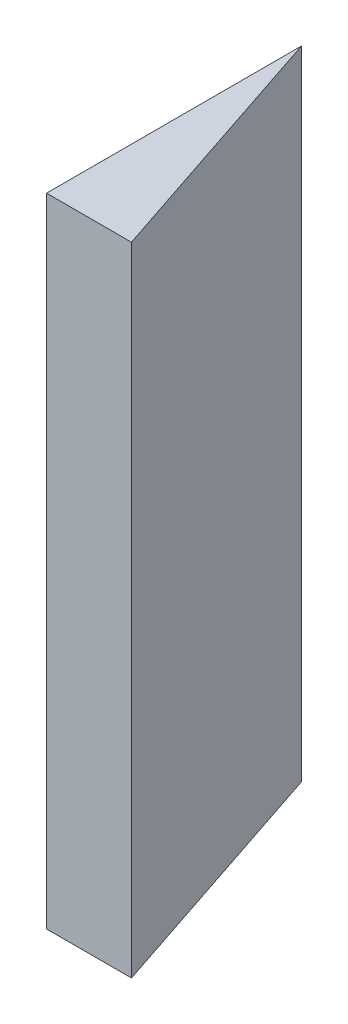
ISO-10303-21;
HEADER;
FILE_DESCRIPTION(('STEP AP214'),'2;1');
FILE_NAME('part.step','',(''),(''),'','','');
FILE_SCHEMA(('AUTOMOTIVE_DESIGN { 1 0 10303 214 1 1 1 1 }'));
ENDSEC;
DATA;
#1=APPLICATION_CONTEXT('core data for automotive mechanical design processes');
#2=APPLICATION_PROTOCOL_DEFINITION('international standard','automotive_design',2000,#1);
#3=PRODUCT_CONTEXT('',#1,'mechanical');
#4=PRODUCT('Part','Part','',(#3));
#5=PRODUCT_RELATED_PRODUCT_CATEGORY('part','',(#4));
#6=PRODUCT_DEFINITION_FORMATION('','',#4);
#7=PRODUCT_DEFINITION_CONTEXT('part definition',#1,'design');
#8=PRODUCT_DEFINITION('design','',#6,#7);
#9=PRODUCT_DEFINITION_SHAPE('','',#8);
#10=(LENGTH_UNIT() NAMED_UNIT(*) SI_UNIT(.MILLI.,.METRE.));
#11=(NAMED_UNIT(*) PLANE_ANGLE_UNIT() SI_UNIT($,.RADIAN.));
#12=(NAMED_UNIT(*) SI_UNIT($,.STERADIAN.) SOLID_ANGLE_UNIT());
#13=UNCERTAINTY_MEASURE_WITH_UNIT(LENGTH_MEASURE(1.E-05),#10,'distance_accuracy_value','');
#14=(GEOMETRIC_REPRESENTATION_CONTEXT(3) GLOBAL_UNCERTAINTY_ASSIGNED_CONTEXT((#13)) GLOBAL_UNIT_ASSIGNED_CONTEXT((#10,
#11,#12)) REPRESENTATION_CONTEXT('',''));
#15=CARTESIAN_POINT('',(0.,0.,0.));
#16=DIRECTION('',(0.,0.,1.));
#17=DIRECTION('',(1.,0.,0.));
#18=AXIS2_PLACEMENT_3D('',#15,#16,#17);
#19=CARTESIAN_POINT('',(-3.92000013113415,-0.749999132765057,-3.67112145542904));
#20=DIRECTION('',(-1.74845553146952E-07,-1.,8.74227765734759E-08));
#21=DIRECTION('',(1.,-1.74845553146952E-07,0.));
#22=AXIS2_PLACEMENT_3D('',#19,#20,#21);
#23=PLANE('',#22);
#24=DIRECTION('',(0.,-8.74227765179645E-08,-0.999999999999996));
#25=VECTOR('',#24,1.);
#26=CARTESIAN_POINT('',(-3.90000013113415,-0.749999099544401,-3.25112145542904));
#27=LINE('',#26,#25);
#28=CARTESIAN_POINT('',(-3.90000013113415,-0.749999099546401,-3.25112145542904));
#29=VERTEX_POINT('',#28);
#30=CARTESIAN_POINT('',(-3.90000013113415,-0.749999134515512,-3.65112145542904));
#31=VERTEX_POINT('',#30);
#32=EDGE_CURVE('E11',#29,#31,#27,.T.);
#33=ORIENTED_EDGE('',*,*,#32,.F.);
#34=DIRECTION('',(-0.999999999999985,1.74845553322983E-07,0.));
#35=VECTOR('',#34,1.);
#36=CARTESIAN_POINT('',(-3.76677795649015,-0.749999122837706,-3.25112145542904));
#37=LINE('',#36,#35);
#38=CARTESIAN_POINT('',(-3.76677795649015,-0.749999122839706,-3.25112145542904));
#39=VERTEX_POINT('',#38);
#40=EDGE_CURVE('E63',#39,#29,#37,.T.);
#41=ORIENTED_EDGE('',*,*,#40,.F.);
#42=DIRECTION('',(0.315990463967212,2.76939127533256E-08,0.948762365759617));
#43=VECTOR('',#42,1.);
#44=CARTESIAN_POINT('',(-3.90000013113415,-0.749999134513512,-3.65112145542904));
#45=LINE('',#44,#43);
#46=EDGE_CURVE('E70',#31,#39,#45,.T.);
#47=ORIENTED_EDGE('',*,*,#46,.F.);
#48=EDGE_LOOP('',(#33,#41,#47));
#49=FACE_BOUND('',#48,.T.);
#50=ADVANCED_FACE('F17',(#49),#23,.F.);
#51=CARTESIAN_POINT('',(-3.9200003059797,-1.74999913276606,-3.67112136800626));
#52=DIRECTION('',(-1.74845553146952E-07,-1.,8.74227765734759E-08));
#53=DIRECTION('',(1.,-1.74845553146952E-07,0.));
#54=AXIS2_PLACEMENT_3D('',#51,#52,#53);
#55=PLANE('',#54);
#56=DIRECTION('',(0.315990463967212,2.76939124899912E-08,0.948762365759617));
#57=VECTOR('',#56,1.);
#58=CARTESIAN_POINT('',(-3.9000003059797,-1.74999913451451,-3.65112136800626));
#59=LINE('',#58,#57);
#60=CARTESIAN_POINT('',(-3.9000003059797,-1.74999913451351,-3.65112136800626));
#61=VERTEX_POINT('',#60);
#62=CARTESIAN_POINT('',(-3.7667781313357,-1.74999912283771,-3.25112136800626));
#63=VERTEX_POINT('',#62);
#64=EDGE_CURVE('E24',#61,#63,#59,.T.);
#65=ORIENTED_EDGE('',*,*,#64,.T.);
#66=DIRECTION('',(-0.999999999999985,1.74845553322982E-07,0.));
#67=VECTOR('',#66,1.);
#68=CARTESIAN_POINT('',(-3.7667781313357,-1.74999912283871,-3.25112136800626));
#69=LINE('',#68,#67);
#70=CARTESIAN_POINT('',(-3.9000003059797,-1.7499990995444,-3.25112136800626));
#71=VERTEX_POINT('',#70);
#72=EDGE_CURVE('E49',#63,#71,#69,.T.);
#73=ORIENTED_EDGE('',*,*,#72,.T.);
#74=DIRECTION('',(0.,-8.74227762404086E-08,-0.999999999999996));
#75=VECTOR('',#74,1.);
#76=CARTESIAN_POINT('',(-3.9000003059797,-1.7499990995454,-3.25112136800626));
#77=LINE('',#76,#75);
#78=EDGE_CURVE('E46',#71,#61,#77,.T.);
#79=ORIENTED_EDGE('',*,*,#78,.T.);
#80=EDGE_LOOP('',(#65,#73,#79));
#81=FACE_BOUND('',#80,.T.);
#82=ADVANCED_FACE('F47',(#81),#55,.T.);
#83=CARTESIAN_POINT('',(-3.90000013113415,-0.749999134513512,-3.65112145542904));
#84=DIRECTION('',(0.948762365759617,-1.93511644350672E-07,-0.315990463967199));
#85=DIRECTION('',(0.315990463967214,2.76939128616174E-08,0.948762365759622));
#86=AXIS2_PLACEMENT_3D('',#83,#84,#85);
#87=PLANE('',#86);
#88=ORIENTED_EDGE('',*,*,#46,.T.);
#89=DIRECTION('',(-1.74845553146774E-07,-0.999999999999981,8.74227765733868E-08));
#90=VECTOR('',#89,1.);
#91=CARTESIAN_POINT('',(-3.76677795649015,-0.749999122837706,-3.25112145542904));
#92=LINE('',#91,#90);
#93=EDGE_CURVE('E54',#39,#63,#92,.T.);
#94=ORIENTED_EDGE('',*,*,#93,.T.);
#95=ORIENTED_EDGE('',*,*,#64,.F.);
#96=DIRECTION('',(-1.74845553146774E-07,-0.999999999999981,8.74227765733868E-08));
#97=VECTOR('',#96,1.);
#98=CARTESIAN_POINT('',(-3.90000013113415,-0.749999134513512,-3.65112145542904));
#99=LINE('',#98,#97);
#100=EDGE_CURVE('E61',#31,#61,#99,.T.);
#101=ORIENTED_EDGE('',*,*,#100,.F.);
#102=EDGE_LOOP('',(#88,#94,#95,#101));
#103=FACE_BOUND('',#102,.T.);
#104=ADVANCED_FACE('F60',(#103),#87,.T.);
#105=CARTESIAN_POINT('',(-3.76677795649015,-0.749999122837706,-3.25112145542904));
#106=DIRECTION('',(0.,8.74227765734759E-08,1.));
#107=DIRECTION('',(-1.,1.74845553146952E-07,0.));
#108=AXIS2_PLACEMENT_3D('',#105,#106,#107);
#109=PLANE('',#108);
#110=ORIENTED_EDGE('',*,*,#40,.T.);
#111=DIRECTION('',(-1.74845553146774E-07,-0.999999999999981,8.74227765733868E-08));
#112=VECTOR('',#111,1.);
#113=CARTESIAN_POINT('',(-3.90000013113415,-0.749999099544401,-3.25112145542904));
#114=LINE('',#113,#112);
#115=EDGE_CURVE('E55',#29,#71,#114,.T.);
#116=ORIENTED_EDGE('',*,*,#115,.T.);
#117=ORIENTED_EDGE('',*,*,#72,.F.);
#118=ORIENTED_EDGE('',*,*,#93,.F.);
#119=EDGE_LOOP('',(#110,#116,#117,#118));
#120=FACE_BOUND('',#119,.T.);
#121=ADVANCED_FACE('F73',(#120),#109,.T.);
#122=CARTESIAN_POINT('',(-3.90000013113415,-0.749999099544401,-3.25112145542904));
#123=DIRECTION('',(-1.,1.74845553146952E-07,0.));
#124=DIRECTION('',(0.,-8.74227765734759E-08,-1.));
#125=AXIS2_PLACEMENT_3D('',#122,#123,#124);
#126=PLANE('',#125);
#127=ORIENTED_EDGE('',*,*,#32,.T.);
#128=ORIENTED_EDGE('',*,*,#100,.T.);
#129=ORIENTED_EDGE('',*,*,#78,.F.);
#130=ORIENTED_EDGE('',*,*,#115,.F.);
#131=EDGE_LOOP('',(#127,#128,#129,#130));
#132=FACE_BOUND('',#131,.T.);
#133=ADVANCED_FACE('F64',(#132),#126,.T.);
#134=CLOSED_SHELL('',(#50,#82,#104,#121,#133));
#135=MANIFOLD_SOLID_BREP('B1',#134);
#136=ADVANCED_BREP_SHAPE_REPRESENTATION('',(#18,#135),#14);
#137=SHAPE_DEFINITION_REPRESENTATION(#9,#136);
ENDSEC;
END-ISO-10303-21;
